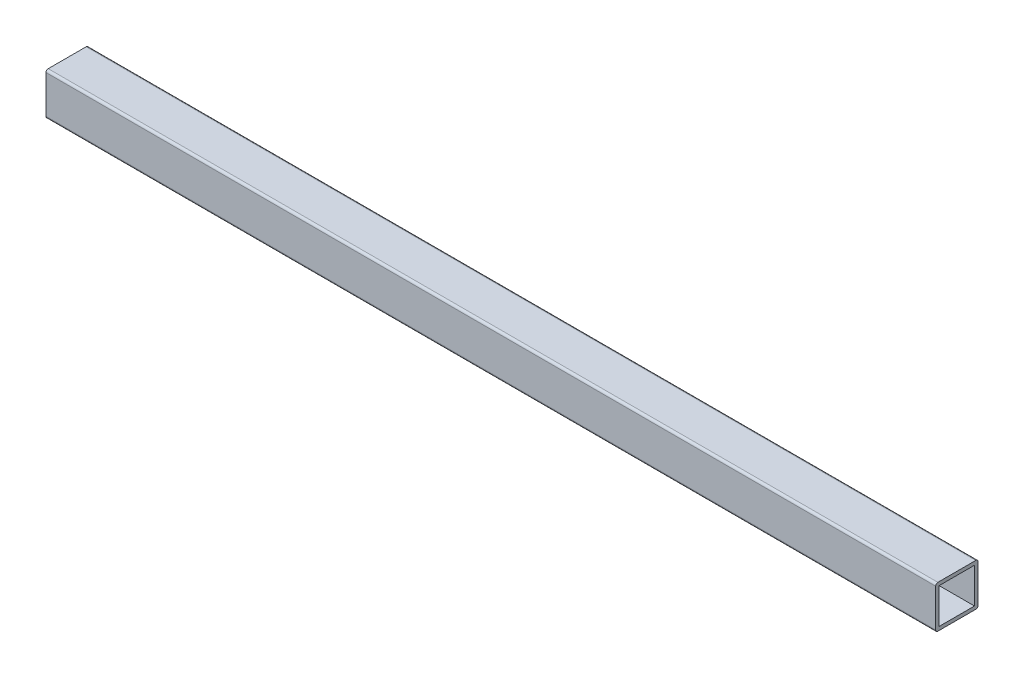
ISO-10303-21;
HEADER;
FILE_DESCRIPTION(('STEP AP214'),'2;1');
FILE_NAME('part.step','',(''),(''),'','','');
FILE_SCHEMA(('AUTOMOTIVE_DESIGN { 1 0 10303 214 1 1 1 1 }'));
ENDSEC;
DATA;
#1=APPLICATION_CONTEXT('core data for automotive mechanical design processes');
#2=APPLICATION_PROTOCOL_DEFINITION('international standard','automotive_design',2000,#1);
#3=PRODUCT_CONTEXT('',#1,'mechanical');
#4=PRODUCT('Part','Part','',(#3));
#5=PRODUCT_RELATED_PRODUCT_CATEGORY('part','',(#4));
#6=PRODUCT_DEFINITION_FORMATION('','',#4);
#7=PRODUCT_DEFINITION_CONTEXT('part definition',#1,'design');
#8=PRODUCT_DEFINITION('design','',#6,#7);
#9=PRODUCT_DEFINITION_SHAPE('','',#8);
#10=(LENGTH_UNIT() NAMED_UNIT(*) SI_UNIT(.MILLI.,.METRE.));
#11=(NAMED_UNIT(*) PLANE_ANGLE_UNIT() SI_UNIT($,.RADIAN.));
#12=(NAMED_UNIT(*) SI_UNIT($,.STERADIAN.) SOLID_ANGLE_UNIT());
#13=UNCERTAINTY_MEASURE_WITH_UNIT(LENGTH_MEASURE(1.E-05),#10,'distance_accuracy_value','');
#14=(GEOMETRIC_REPRESENTATION_CONTEXT(3) GLOBAL_UNCERTAINTY_ASSIGNED_CONTEXT((#13)) GLOBAL_UNIT_ASSIGNED_CONTEXT((#10,
#11,#12)) REPRESENTATION_CONTEXT('',''));
#15=CARTESIAN_POINT('',(0.,0.,0.));
#16=DIRECTION('',(0.,0.,1.));
#17=DIRECTION('',(1.,0.,0.));
#18=AXIS2_PLACEMENT_3D('',#15,#16,#17);
#19=CARTESIAN_POINT('',(400.,0.,0.));
#20=DIRECTION('',(-1.,0.,0.));
#21=DIRECTION('',(0.,0.,1.));
#22=AXIS2_PLACEMENT_3D('',#19,#20,#21);
#23=PLANE('',#22);
#24=DIRECTION('',(0.,0.,-1.));
#25=VECTOR('',#24,1.);
#26=CARTESIAN_POINT('',(400.,-9.525,9.525));
#27=LINE('',#26,#25);
#28=CARTESIAN_POINT('',(400.,-9.525,8.525));
#29=VERTEX_POINT('',#28);
#30=CARTESIAN_POINT('',(400.,-9.525,-8.525));
#31=VERTEX_POINT('',#30);
#32=EDGE_CURVE('E174',#29,#31,#27,.T.);
#33=ORIENTED_EDGE('',*,*,#32,.T.);
#34=CARTESIAN_POINT('',(400.,-8.525,-8.525));
#35=DIRECTION('',(-1.,0.,0.));
#36=DIRECTION('',(0.,0.,1.));
#37=AXIS2_PLACEMENT_3D('',#34,#35,#36);
#38=CIRCLE('',#37,1.);
#39=CARTESIAN_POINT('',(400.,-8.525,-9.525));
#40=VERTEX_POINT('',#39);
#41=EDGE_CURVE('E209',#31,#40,#38,.F.);
#42=ORIENTED_EDGE('',*,*,#41,.T.);
#43=DIRECTION('',(0.,1.,0.));
#44=VECTOR('',#43,1.);
#45=CARTESIAN_POINT('',(400.,-9.525,-9.525));
#46=LINE('',#45,#44);
#47=CARTESIAN_POINT('',(400.,8.525,-9.525));
#48=VERTEX_POINT('',#47);
#49=EDGE_CURVE('E166',#40,#48,#46,.T.);
#50=ORIENTED_EDGE('',*,*,#49,.T.);
#51=CARTESIAN_POINT('',(400.,8.525,-8.525));
#52=DIRECTION('',(-1.,0.,0.));
#53=DIRECTION('',(0.,0.,1.));
#54=AXIS2_PLACEMENT_3D('',#51,#52,#53);
#55=CIRCLE('',#54,1.);
#56=CARTESIAN_POINT('',(400.,9.525,-8.52499999999999));
#57=VERTEX_POINT('',#56);
#58=EDGE_CURVE('E205',#48,#57,#55,.F.);
#59=ORIENTED_EDGE('',*,*,#58,.T.);
#60=DIRECTION('',(0.,0.,1.));
#61=VECTOR('',#60,1.);
#62=CARTESIAN_POINT('',(400.,9.525,9.525));
#63=LINE('',#62,#61);
#64=CARTESIAN_POINT('',(400.,9.525,8.525));
#65=VERTEX_POINT('',#64);
#66=EDGE_CURVE('E169',#57,#65,#63,.T.);
#67=ORIENTED_EDGE('',*,*,#66,.T.);
#68=CARTESIAN_POINT('',(400.,8.525,8.525));
#69=DIRECTION('',(-1.,0.,0.));
#70=DIRECTION('',(0.,0.,1.));
#71=AXIS2_PLACEMENT_3D('',#68,#69,#70);
#72=CIRCLE('',#71,1.);
#73=CARTESIAN_POINT('',(400.,8.52499999999999,9.525));
#74=VERTEX_POINT('',#73);
#75=EDGE_CURVE('E55',#65,#74,#72,.F.);
#76=ORIENTED_EDGE('',*,*,#75,.T.);
#77=DIRECTION('',(0.,-1.,0.));
#78=VECTOR('',#77,1.);
#79=CARTESIAN_POINT('',(400.,-9.525,9.525));
#80=LINE('',#79,#78);
#81=CARTESIAN_POINT('',(400.,-8.525,9.525));
#82=VERTEX_POINT('',#81);
#83=EDGE_CURVE('E172',#74,#82,#80,.T.);
#84=ORIENTED_EDGE('',*,*,#83,.T.);
#85=CARTESIAN_POINT('',(400.,-8.525,8.525));
#86=DIRECTION('',(-1.,0.,0.));
#87=DIRECTION('',(0.,0.,1.));
#88=AXIS2_PLACEMENT_3D('',#85,#86,#87);
#89=CIRCLE('',#88,1.);
#90=EDGE_CURVE('E207',#82,#29,#89,.F.);
#91=ORIENTED_EDGE('',*,*,#90,.T.);
#92=EDGE_LOOP('',(#33,#42,#50,#59,#67,#76,#84,#91));
#93=FACE_BOUND('',#92,.T.);
#94=DIRECTION('',(0.,0.,-1.));
#95=VECTOR('',#94,1.);
#96=CARTESIAN_POINT('',(400.,-7.9375,7.9375));
#97=LINE('',#96,#95);
#98=CARTESIAN_POINT('',(400.,-7.9375,7.9375));
#99=VERTEX_POINT('',#98);
#100=CARTESIAN_POINT('',(400.,-7.9375,-7.9375));
#101=VERTEX_POINT('',#100);
#102=EDGE_CURVE('E125',#99,#101,#97,.T.);
#103=ORIENTED_EDGE('',*,*,#102,.F.);
#104=DIRECTION('',(0.,-1.,0.));
#105=VECTOR('',#104,1.);
#106=CARTESIAN_POINT('',(400.,-7.9375,7.9375));
#107=LINE('',#106,#105);
#108=CARTESIAN_POINT('',(400.,7.9375,7.9375));
#109=VERTEX_POINT('',#108);
#110=EDGE_CURVE('E150',#109,#99,#107,.T.);
#111=ORIENTED_EDGE('',*,*,#110,.F.);
#112=DIRECTION('',(0.,0.,1.));
#113=VECTOR('',#112,1.);
#114=CARTESIAN_POINT('',(400.,7.9375,7.9375));
#115=LINE('',#114,#113);
#116=CARTESIAN_POINT('',(400.,7.9375,-7.9375));
#117=VERTEX_POINT('',#116);
#118=EDGE_CURVE('E148',#117,#109,#115,.T.);
#119=ORIENTED_EDGE('',*,*,#118,.F.);
#120=DIRECTION('',(0.,1.,0.));
#121=VECTOR('',#120,1.);
#122=CARTESIAN_POINT('',(400.,-7.9375,-7.9375));
#123=LINE('',#122,#121);
#124=EDGE_CURVE('E135',#101,#117,#123,.T.);
#125=ORIENTED_EDGE('',*,*,#124,.F.);
#126=EDGE_LOOP('',(#103,#111,#119,#125));
#127=FACE_BOUND('',#126,.T.);
#128=ADVANCED_FACE('F33',(#93,#127),#23,.F.);
#129=CARTESIAN_POINT('',(0.,0.,0.));
#130=DIRECTION('',(-1.,0.,0.));
#131=DIRECTION('',(0.,0.,1.));
#132=AXIS2_PLACEMENT_3D('',#129,#130,#131);
#133=PLANE('',#132);
#134=DIRECTION('',(0.,1.,0.));
#135=VECTOR('',#134,1.);
#136=CARTESIAN_POINT('',(0.,-9.525,-9.525));
#137=LINE('',#136,#135);
#138=CARTESIAN_POINT('',(0.,-8.525,-9.525));
#139=VERTEX_POINT('',#138);
#140=CARTESIAN_POINT('',(0.,8.525,-9.525));
#141=VERTEX_POINT('',#140);
#142=EDGE_CURVE('E143',#139,#141,#137,.T.);
#143=ORIENTED_EDGE('',*,*,#142,.F.);
#144=CARTESIAN_POINT('',(0.,-8.525,-8.525));
#145=DIRECTION('',(-1.,0.,0.));
#146=DIRECTION('',(0.,0.,1.));
#147=AXIS2_PLACEMENT_3D('',#144,#145,#146);
#148=CIRCLE('',#147,1.);
#149=CARTESIAN_POINT('',(0.,-9.525,-8.525));
#150=VERTEX_POINT('',#149);
#151=EDGE_CURVE('E197',#139,#150,#148,.T.);
#152=ORIENTED_EDGE('',*,*,#151,.T.);
#153=DIRECTION('',(0.,0.,-1.));
#154=VECTOR('',#153,1.);
#155=CARTESIAN_POINT('',(0.,-9.525,9.525));
#156=LINE('',#155,#154);
#157=CARTESIAN_POINT('',(0.,-9.525,8.525));
#158=VERTEX_POINT('',#157);
#159=EDGE_CURVE('E170',#158,#150,#156,.T.);
#160=ORIENTED_EDGE('',*,*,#159,.F.);
#161=CARTESIAN_POINT('',(0.,-8.525,8.525));
#162=DIRECTION('',(-1.,0.,0.));
#163=DIRECTION('',(0.,0.,1.));
#164=AXIS2_PLACEMENT_3D('',#161,#162,#163);
#165=CIRCLE('',#164,1.);
#166=CARTESIAN_POINT('',(0.,-8.525,9.525));
#167=VERTEX_POINT('',#166);
#168=EDGE_CURVE('E195',#158,#167,#165,.T.);
#169=ORIENTED_EDGE('',*,*,#168,.T.);
#170=DIRECTION('',(0.,-1.,0.));
#171=VECTOR('',#170,1.);
#172=CARTESIAN_POINT('',(0.,-9.525,9.525));
#173=LINE('',#172,#171);
#174=CARTESIAN_POINT('',(0.,8.52499999999999,9.525));
#175=VERTEX_POINT('',#174);
#176=EDGE_CURVE('E183',#175,#167,#173,.T.);
#177=ORIENTED_EDGE('',*,*,#176,.F.);
#178=CARTESIAN_POINT('',(0.,8.525,8.525));
#179=DIRECTION('',(-1.,0.,0.));
#180=DIRECTION('',(0.,0.,1.));
#181=AXIS2_PLACEMENT_3D('',#178,#179,#180);
#182=CIRCLE('',#181,1.);
#183=CARTESIAN_POINT('',(0.,9.525,8.525));
#184=VERTEX_POINT('',#183);
#185=EDGE_CURVE('E191',#175,#184,#182,.T.);
#186=ORIENTED_EDGE('',*,*,#185,.T.);
#187=DIRECTION('',(0.,0.,1.));
#188=VECTOR('',#187,1.);
#189=CARTESIAN_POINT('',(0.,9.525,9.525));
#190=LINE('',#189,#188);
#191=CARTESIAN_POINT('',(0.,9.525,-8.52499999999999));
#192=VERTEX_POINT('',#191);
#193=EDGE_CURVE('E180',#192,#184,#190,.T.);
#194=ORIENTED_EDGE('',*,*,#193,.F.);
#195=CARTESIAN_POINT('',(0.,8.525,-8.525));
#196=DIRECTION('',(-1.,0.,0.));
#197=DIRECTION('',(0.,0.,1.));
#198=AXIS2_PLACEMENT_3D('',#195,#196,#197);
#199=CIRCLE('',#198,1.);
#200=EDGE_CURVE('E193',#192,#141,#199,.T.);
#201=ORIENTED_EDGE('',*,*,#200,.T.);
#202=EDGE_LOOP('',(#143,#152,#160,#169,#177,#186,#194,#201));
#203=FACE_BOUND('',#202,.T.);
#204=DIRECTION('',(0.,-1.,0.));
#205=VECTOR('',#204,1.);
#206=CARTESIAN_POINT('',(0.,-7.9375,7.9375));
#207=LINE('',#206,#205);
#208=CARTESIAN_POINT('',(0.,7.9375,7.9375));
#209=VERTEX_POINT('',#208);
#210=CARTESIAN_POINT('',(0.,-7.9375,7.9375));
#211=VERTEX_POINT('',#210);
#212=EDGE_CURVE('E136',#209,#211,#207,.T.);
#213=ORIENTED_EDGE('',*,*,#212,.T.);
#214=DIRECTION('',(0.,0.,-1.));
#215=VECTOR('',#214,1.);
#216=CARTESIAN_POINT('',(0.,-7.9375,7.9375));
#217=LINE('',#216,#215);
#218=CARTESIAN_POINT('',(0.,-7.9375,-7.9375));
#219=VERTEX_POINT('',#218);
#220=EDGE_CURVE('E154',#211,#219,#217,.T.);
#221=ORIENTED_EDGE('',*,*,#220,.T.);
#222=DIRECTION('',(0.,1.,0.));
#223=VECTOR('',#222,1.);
#224=CARTESIAN_POINT('',(0.,-7.9375,-7.9375));
#225=LINE('',#224,#223);
#226=CARTESIAN_POINT('',(0.,7.9375,-7.9375));
#227=VERTEX_POINT('',#226);
#228=EDGE_CURVE('E142',#219,#227,#225,.T.);
#229=ORIENTED_EDGE('',*,*,#228,.T.);
#230=DIRECTION('',(0.,0.,1.));
#231=VECTOR('',#230,1.);
#232=CARTESIAN_POINT('',(0.,7.9375,7.9375));
#233=LINE('',#232,#231);
#234=EDGE_CURVE('E157',#227,#209,#233,.T.);
#235=ORIENTED_EDGE('',*,*,#234,.T.);
#236=EDGE_LOOP('',(#213,#221,#229,#235));
#237=FACE_BOUND('',#236,.T.);
#238=ADVANCED_FACE('F227',(#203,#237),#133,.T.);
#239=CARTESIAN_POINT('',(400.,-9.525,-9.525));
#240=DIRECTION('',(0.,0.,1.));
#241=DIRECTION('',(1.,0.,0.));
#242=AXIS2_PLACEMENT_3D('',#239,#240,#241);
#243=PLANE('',#242);
#244=ORIENTED_EDGE('',*,*,#49,.F.);
#245=DIRECTION('',(-1.,0.,0.));
#246=VECTOR('',#245,1.);
#247=CARTESIAN_POINT('',(400.,-8.525,-9.525));
#248=LINE('',#247,#246);
#249=EDGE_CURVE('E188',#40,#139,#248,.T.);
#250=ORIENTED_EDGE('',*,*,#249,.T.);
#251=ORIENTED_EDGE('',*,*,#142,.T.);
#252=DIRECTION('',(-1.,0.,0.));
#253=VECTOR('',#252,1.);
#254=CARTESIAN_POINT('',(400.,8.525,-9.525));
#255=LINE('',#254,#253);
#256=EDGE_CURVE('E177',#141,#48,#255,.F.);
#257=ORIENTED_EDGE('',*,*,#256,.T.);
#258=EDGE_LOOP('',(#244,#250,#251,#257));
#259=FACE_BOUND('',#258,.T.);
#260=ADVANCED_FACE('F244',(#259),#243,.F.);
#261=CARTESIAN_POINT('',(400.,9.525,9.525));
#262=DIRECTION('',(0.,-1.,0.));
#263=DIRECTION('',(0.,0.,-1.));
#264=AXIS2_PLACEMENT_3D('',#261,#262,#263);
#265=PLANE('',#264);
#266=ORIENTED_EDGE('',*,*,#66,.F.);
#267=DIRECTION('',(-1.,0.,0.));
#268=VECTOR('',#267,1.);
#269=CARTESIAN_POINT('',(400.,9.525,-8.525));
#270=LINE('',#269,#268);
#271=EDGE_CURVE('E11',#57,#192,#270,.T.);
#272=ORIENTED_EDGE('',*,*,#271,.T.);
#273=ORIENTED_EDGE('',*,*,#193,.T.);
#274=DIRECTION('',(-1.,0.,0.));
#275=VECTOR('',#274,1.);
#276=CARTESIAN_POINT('',(400.,9.525,8.525));
#277=LINE('',#276,#275);
#278=EDGE_CURVE('E41',#184,#65,#277,.F.);
#279=ORIENTED_EDGE('',*,*,#278,.T.);
#280=EDGE_LOOP('',(#266,#272,#273,#279));
#281=FACE_BOUND('',#280,.T.);
#282=ADVANCED_FACE('F217',(#281),#265,.F.);
#283=CARTESIAN_POINT('',(400.,-9.525,9.525));
#284=DIRECTION('',(0.,0.,-1.));
#285=DIRECTION('',(-1.,0.,0.));
#286=AXIS2_PLACEMENT_3D('',#283,#284,#285);
#287=PLANE('',#286);
#288=ORIENTED_EDGE('',*,*,#176,.T.);
#289=DIRECTION('',(-1.,0.,0.));
#290=VECTOR('',#289,1.);
#291=CARTESIAN_POINT('',(400.,-8.525,9.525));
#292=LINE('',#291,#290);
#293=EDGE_CURVE('E48',#167,#82,#292,.F.);
#294=ORIENTED_EDGE('',*,*,#293,.T.);
#295=ORIENTED_EDGE('',*,*,#83,.F.);
#296=DIRECTION('',(-1.,0.,0.));
#297=VECTOR('',#296,1.);
#298=CARTESIAN_POINT('',(400.,8.525,9.525));
#299=LINE('',#298,#297);
#300=EDGE_CURVE('E211',#74,#175,#299,.T.);
#301=ORIENTED_EDGE('',*,*,#300,.T.);
#302=EDGE_LOOP('',(#288,#294,#295,#301));
#303=FACE_BOUND('',#302,.T.);
#304=ADVANCED_FACE('F224',(#303),#287,.F.);
#305=CARTESIAN_POINT('',(400.,-9.525,9.525));
#306=DIRECTION('',(0.,1.,0.));
#307=DIRECTION('',(0.,0.,1.));
#308=AXIS2_PLACEMENT_3D('',#305,#306,#307);
#309=PLANE('',#308);
#310=ORIENTED_EDGE('',*,*,#159,.T.);
#311=DIRECTION('',(-1.,0.,0.));
#312=VECTOR('',#311,1.);
#313=CARTESIAN_POINT('',(400.,-9.525,-8.525));
#314=LINE('',#313,#312);
#315=EDGE_CURVE('E202',#150,#31,#314,.F.);
#316=ORIENTED_EDGE('',*,*,#315,.T.);
#317=ORIENTED_EDGE('',*,*,#32,.F.);
#318=DIRECTION('',(-1.,0.,0.));
#319=VECTOR('',#318,1.);
#320=CARTESIAN_POINT('',(400.,-9.525,8.525));
#321=LINE('',#320,#319);
#322=EDGE_CURVE('E199',#29,#158,#321,.T.);
#323=ORIENTED_EDGE('',*,*,#322,.T.);
#324=EDGE_LOOP('',(#310,#316,#317,#323));
#325=FACE_BOUND('',#324,.T.);
#326=ADVANCED_FACE('F236',(#325),#309,.F.);
#327=CARTESIAN_POINT('',(400.,-7.9375,7.9375));
#328=DIRECTION('',(0.,1.,0.));
#329=DIRECTION('',(0.,0.,1.));
#330=AXIS2_PLACEMENT_3D('',#327,#328,#329);
#331=PLANE('',#330);
#332=ORIENTED_EDGE('',*,*,#220,.F.);
#333=DIRECTION('',(-1.,0.,0.));
#334=VECTOR('',#333,1.);
#335=CARTESIAN_POINT('',(400.,-7.9375,7.9375));
#336=LINE('',#335,#334);
#337=EDGE_CURVE('E131',#99,#211,#336,.T.);
#338=ORIENTED_EDGE('',*,*,#337,.F.);
#339=ORIENTED_EDGE('',*,*,#102,.T.);
#340=DIRECTION('',(-1.,0.,0.));
#341=VECTOR('',#340,1.);
#342=CARTESIAN_POINT('',(400.,-7.9375,-7.9375));
#343=LINE('',#342,#341);
#344=EDGE_CURVE('E128',#101,#219,#343,.T.);
#345=ORIENTED_EDGE('',*,*,#344,.T.);
#346=EDGE_LOOP('',(#332,#338,#339,#345));
#347=FACE_BOUND('',#346,.T.);
#348=ADVANCED_FACE('F127',(#347),#331,.T.);
#349=CARTESIAN_POINT('',(400.,-7.9375,-7.9375));
#350=DIRECTION('',(0.,0.,1.));
#351=DIRECTION('',(1.,0.,0.));
#352=AXIS2_PLACEMENT_3D('',#349,#350,#351);
#353=PLANE('',#352);
#354=ORIENTED_EDGE('',*,*,#228,.F.);
#355=ORIENTED_EDGE('',*,*,#344,.F.);
#356=ORIENTED_EDGE('',*,*,#124,.T.);
#357=DIRECTION('',(-1.,0.,0.));
#358=VECTOR('',#357,1.);
#359=CARTESIAN_POINT('',(400.,7.9375,-7.9375));
#360=LINE('',#359,#358);
#361=EDGE_CURVE('E144',#117,#227,#360,.T.);
#362=ORIENTED_EDGE('',*,*,#361,.T.);
#363=EDGE_LOOP('',(#354,#355,#356,#362));
#364=FACE_BOUND('',#363,.T.);
#365=ADVANCED_FACE('F139',(#364),#353,.T.);
#366=CARTESIAN_POINT('',(400.,7.9375,7.9375));
#367=DIRECTION('',(0.,-1.,0.));
#368=DIRECTION('',(0.,0.,-1.));
#369=AXIS2_PLACEMENT_3D('',#366,#367,#368);
#370=PLANE('',#369);
#371=ORIENTED_EDGE('',*,*,#234,.F.);
#372=ORIENTED_EDGE('',*,*,#361,.F.);
#373=ORIENTED_EDGE('',*,*,#118,.T.);
#374=DIRECTION('',(-1.,0.,0.));
#375=VECTOR('',#374,1.);
#376=CARTESIAN_POINT('',(400.,7.9375,7.9375));
#377=LINE('',#376,#375);
#378=EDGE_CURVE('E163',#109,#209,#377,.T.);
#379=ORIENTED_EDGE('',*,*,#378,.T.);
#380=EDGE_LOOP('',(#371,#372,#373,#379));
#381=FACE_BOUND('',#380,.T.);
#382=ADVANCED_FACE('F277',(#381),#370,.T.);
#383=CARTESIAN_POINT('',(400.,-7.9375,7.9375));
#384=DIRECTION('',(0.,0.,-1.));
#385=DIRECTION('',(-1.,0.,0.));
#386=AXIS2_PLACEMENT_3D('',#383,#384,#385);
#387=PLANE('',#386);
#388=ORIENTED_EDGE('',*,*,#212,.F.);
#389=ORIENTED_EDGE('',*,*,#378,.F.);
#390=ORIENTED_EDGE('',*,*,#110,.T.);
#391=ORIENTED_EDGE('',*,*,#337,.T.);
#392=EDGE_LOOP('',(#388,#389,#390,#391));
#393=FACE_BOUND('',#392,.T.);
#394=ADVANCED_FACE('F273',(#393),#387,.T.);
#395=CARTESIAN_POINT('',(400.,-8.525,-8.525));
#396=DIRECTION('',(-1.,0.,0.));
#397=DIRECTION('',(0.,0.,1.));
#398=AXIS2_PLACEMENT_3D('',#395,#396,#397);
#399=CYLINDRICAL_SURFACE('',#398,1.);
#400=ORIENTED_EDGE('',*,*,#41,.F.);
#401=ORIENTED_EDGE('',*,*,#315,.F.);
#402=ORIENTED_EDGE('',*,*,#151,.F.);
#403=ORIENTED_EDGE('',*,*,#249,.F.);
#404=EDGE_LOOP('',(#400,#401,#402,#403));
#405=FACE_BOUND('',#404,.T.);
#406=ADVANCED_FACE('F242',(#405),#399,.T.);
#407=CARTESIAN_POINT('',(400.,-8.525,8.525));
#408=DIRECTION('',(-1.,0.,0.));
#409=DIRECTION('',(0.,0.,1.));
#410=AXIS2_PLACEMENT_3D('',#407,#408,#409);
#411=CYLINDRICAL_SURFACE('',#410,1.);
#412=ORIENTED_EDGE('',*,*,#90,.F.);
#413=ORIENTED_EDGE('',*,*,#293,.F.);
#414=ORIENTED_EDGE('',*,*,#168,.F.);
#415=ORIENTED_EDGE('',*,*,#322,.F.);
#416=EDGE_LOOP('',(#412,#413,#414,#415));
#417=FACE_BOUND('',#416,.T.);
#418=ADVANCED_FACE('F233',(#417),#411,.T.);
#419=CARTESIAN_POINT('',(400.,8.525,-8.525));
#420=DIRECTION('',(-1.,0.,0.));
#421=DIRECTION('',(0.,0.,1.));
#422=AXIS2_PLACEMENT_3D('',#419,#420,#421);
#423=CYLINDRICAL_SURFACE('',#422,1.);
#424=ORIENTED_EDGE('',*,*,#58,.F.);
#425=ORIENTED_EDGE('',*,*,#256,.F.);
#426=ORIENTED_EDGE('',*,*,#200,.F.);
#427=ORIENTED_EDGE('',*,*,#271,.F.);
#428=EDGE_LOOP('',(#424,#425,#426,#427));
#429=FACE_BOUND('',#428,.T.);
#430=ADVANCED_FACE('F247',(#429),#423,.T.);
#431=CARTESIAN_POINT('',(400.,8.525,8.525));
#432=DIRECTION('',(-1.,0.,0.));
#433=DIRECTION('',(0.,0.,1.));
#434=AXIS2_PLACEMENT_3D('',#431,#432,#433);
#435=CYLINDRICAL_SURFACE('',#434,1.);
#436=ORIENTED_EDGE('',*,*,#75,.F.);
#437=ORIENTED_EDGE('',*,*,#278,.F.);
#438=ORIENTED_EDGE('',*,*,#185,.F.);
#439=ORIENTED_EDGE('',*,*,#300,.F.);
#440=EDGE_LOOP('',(#436,#437,#438,#439));
#441=FACE_BOUND('',#440,.T.);
#442=ADVANCED_FACE('F35',(#441),#435,.T.);
#443=CLOSED_SHELL('',(#128,#238,#260,#282,#304,#326,#348,#365,#382,#394,#406,#418,#430,#442));
#444=MANIFOLD_SOLID_BREP('B2',#443);
#445=ADVANCED_BREP_SHAPE_REPRESENTATION('',(#18,#444),#14);
#446=SHAPE_DEFINITION_REPRESENTATION(#9,#445);
ENDSEC;
END-ISO-10303-21;
